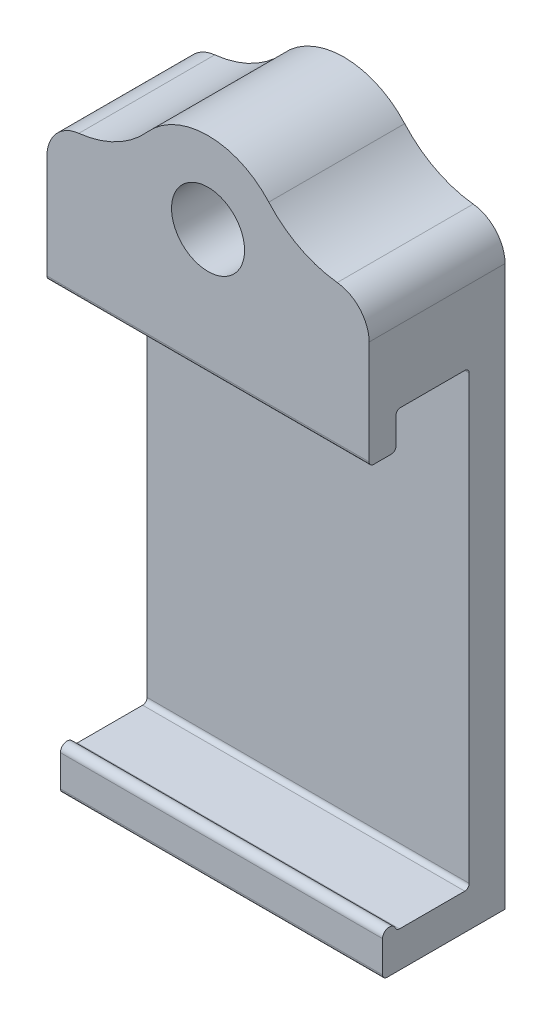
ISO-10303-21;
HEADER;
FILE_DESCRIPTION(('STEP AP214'),'2;1');
FILE_NAME('part.step','',(''),(''),'','','');
FILE_SCHEMA(('AUTOMOTIVE_DESIGN { 1 0 10303 214 1 1 1 1 }'));
ENDSEC;
DATA;
#1=APPLICATION_CONTEXT('core data for automotive mechanical design processes');
#2=APPLICATION_PROTOCOL_DEFINITION('international standard','automotive_design',2000,#1);
#3=PRODUCT_CONTEXT('',#1,'mechanical');
#4=PRODUCT('Part','Part','',(#3));
#5=PRODUCT_RELATED_PRODUCT_CATEGORY('part','',(#4));
#6=PRODUCT_DEFINITION_FORMATION('','',#4);
#7=PRODUCT_DEFINITION_CONTEXT('part definition',#1,'design');
#8=PRODUCT_DEFINITION('design','',#6,#7);
#9=PRODUCT_DEFINITION_SHAPE('','',#8);
#10=(LENGTH_UNIT() NAMED_UNIT(*) SI_UNIT(.MILLI.,.METRE.));
#11=(NAMED_UNIT(*) PLANE_ANGLE_UNIT() SI_UNIT($,.RADIAN.));
#12=(NAMED_UNIT(*) SI_UNIT($,.STERADIAN.) SOLID_ANGLE_UNIT());
#13=UNCERTAINTY_MEASURE_WITH_UNIT(LENGTH_MEASURE(1.E-05),#10,'distance_accuracy_value','');
#14=(GEOMETRIC_REPRESENTATION_CONTEXT(3) GLOBAL_UNCERTAINTY_ASSIGNED_CONTEXT((#13)) GLOBAL_UNIT_ASSIGNED_CONTEXT((#10,
#11,#12)) REPRESENTATION_CONTEXT('',''));
#15=CARTESIAN_POINT('',(0.,0.,0.));
#16=DIRECTION('',(0.,0.,1.));
#17=DIRECTION('',(1.,0.,0.));
#18=AXIS2_PLACEMENT_3D('',#15,#16,#17);
#19=CARTESIAN_POINT('',(14.2875,20.,-3.25));
#20=DIRECTION('',(0.,0.,-1.));
#21=DIRECTION('',(-1.,0.,0.));
#22=AXIS2_PLACEMENT_3D('',#19,#20,#21);
#23=PLANE('',#22);
#24=DIRECTION('',(0.,-1.,0.));
#25=VECTOR('',#24,1.);
#26=CARTESIAN_POINT('',(14.2875,20.,-3.25));
#27=LINE('',#26,#25);
#28=CARTESIAN_POINT('',(14.2875,19.603125,-3.25));
#29=VERTEX_POINT('',#28);
#30=CARTESIAN_POINT('',(14.2875,-19.603125,-3.25));
#31=VERTEX_POINT('',#30);
#32=EDGE_CURVE('E280',#29,#31,#27,.T.);
#33=ORIENTED_EDGE('',*,*,#32,.F.);
#34=DIRECTION('',(-1.,0.,0.));
#35=VECTOR('',#34,1.);
#36=CARTESIAN_POINT('',(-14.2875,19.603125,-3.25));
#37=LINE('',#36,#35);
#38=CARTESIAN_POINT('',(-14.2875,19.603125,-3.25));
#39=VERTEX_POINT('',#38);
#40=EDGE_CURVE('E329',#29,#39,#37,.T.);
#41=ORIENTED_EDGE('',*,*,#40,.T.);
#42=DIRECTION('',(0.,-1.,0.));
#43=VECTOR('',#42,1.);
#44=CARTESIAN_POINT('',(-14.2875,20.,-3.25));
#45=LINE('',#44,#43);
#46=CARTESIAN_POINT('',(-14.2875,-19.603125,-3.25));
#47=VERTEX_POINT('',#46);
#48=EDGE_CURVE('E245',#39,#47,#45,.T.);
#49=ORIENTED_EDGE('',*,*,#48,.T.);
#50=DIRECTION('',(-1.,0.,0.));
#51=VECTOR('',#50,1.);
#52=CARTESIAN_POINT('',(14.2875,-19.603125,-3.25));
#53=LINE('',#52,#51);
#54=EDGE_CURVE('E326',#47,#31,#53,.F.);
#55=ORIENTED_EDGE('',*,*,#54,.T.);
#56=EDGE_LOOP('',(#33,#41,#49,#55));
#57=FACE_BOUND('',#56,.T.);
#58=ADVANCED_FACE('F39',(#57),#23,.F.);
#59=CARTESIAN_POINT('',(14.2875,-20.,-3.25));
#60=DIRECTION('',(0.,-1.,0.));
#61=DIRECTION('',(0.,0.,-1.));
#62=AXIS2_PLACEMENT_3D('',#59,#60,#61);
#63=PLANE('',#62);
#64=DIRECTION('',(0.,0.,1.));
#65=VECTOR('',#64,1.);
#66=CARTESIAN_POINT('',(14.2875,-20.,-3.25));
#67=LINE('',#66,#65);
#68=CARTESIAN_POINT('',(14.2875,-20.,-2.853125));
#69=VERTEX_POINT('',#68);
#70=CARTESIAN_POINT('',(14.2875,-20.,2.9359576355322));
#71=VERTEX_POINT('',#70);
#72=EDGE_CURVE('E203',#69,#71,#67,.T.);
#73=ORIENTED_EDGE('',*,*,#72,.F.);
#74=DIRECTION('',(-1.,0.,0.));
#75=VECTOR('',#74,1.);
#76=CARTESIAN_POINT('',(-14.2875,-20.,-2.853125));
#77=LINE('',#76,#75);
#78=CARTESIAN_POINT('',(-14.2875,-20.,-2.853125));
#79=VERTEX_POINT('',#78);
#80=EDGE_CURVE('E343',#69,#79,#77,.T.);
#81=ORIENTED_EDGE('',*,*,#80,.T.);
#82=DIRECTION('',(0.,0.,1.));
#83=VECTOR('',#82,1.);
#84=CARTESIAN_POINT('',(-14.2875,-20.,-3.25));
#85=LINE('',#84,#83);
#86=CARTESIAN_POINT('',(-14.2875,-20.,2.9359576355322));
#87=VERTEX_POINT('',#86);
#88=EDGE_CURVE('E249',#79,#87,#85,.T.);
#89=ORIENTED_EDGE('',*,*,#88,.T.);
#90=DIRECTION('',(1.,0.,0.));
#91=VECTOR('',#90,1.);
#92=CARTESIAN_POINT('',(14.2875,-20.,2.9359576355322));
#93=LINE('',#92,#91);
#94=EDGE_CURVE('E340',#87,#71,#93,.T.);
#95=ORIENTED_EDGE('',*,*,#94,.T.);
#96=EDGE_LOOP('',(#73,#81,#89,#95));
#97=FACE_BOUND('',#96,.T.);
#98=ADVANCED_FACE('F513',(#97),#63,.F.);
#99=CARTESIAN_POINT('',(14.2875,-20.,3.8453125));
#100=DIRECTION('',(-1.,0.,0.));
#101=DIRECTION('',(0.,0.,1.));
#102=AXIS2_PLACEMENT_3D('',#99,#100,#101);
#103=CYLINDRICAL_SURFACE('',#102,0.595312500000001);
#104=CARTESIAN_POINT('',(14.2875,-20.,3.8453125));
#105=DIRECTION('',(1.,0.,0.));
#106=DIRECTION('',(0.,0.,-1.));
#107=AXIS2_PLACEMENT_3D('',#104,#105,#106);
#108=CIRCLE('',#107,0.595312500000001);
#109=CARTESIAN_POINT('',(14.2875,-19.761875,3.29969958131932));
#110=VERTEX_POINT('',#109);
#111=CARTESIAN_POINT('',(14.2875,-20.,4.440625));
#112=VERTEX_POINT('',#111);
#113=EDGE_CURVE('E189',#110,#112,#108,.T.);
#114=ORIENTED_EDGE('',*,*,#113,.F.);
#115=DIRECTION('',(-1.,0.,0.));
#116=VECTOR('',#115,1.);
#117=CARTESIAN_POINT('',(14.2875,-19.761875,3.29969958131932));
#118=LINE('',#117,#116);
#119=CARTESIAN_POINT('',(-14.2875,-19.761875,3.29969958131932));
#120=VERTEX_POINT('',#119);
#121=EDGE_CURVE('E347',#110,#120,#118,.T.);
#122=ORIENTED_EDGE('',*,*,#121,.T.);
#123=CARTESIAN_POINT('',(-14.2875,-20.,3.8453125));
#124=DIRECTION('',(1.,0.,0.));
#125=DIRECTION('',(0.,0.,-1.));
#126=AXIS2_PLACEMENT_3D('',#123,#124,#125);
#127=CIRCLE('',#126,0.595312500000001);
#128=CARTESIAN_POINT('',(-14.2875,-20.,4.440625));
#129=VERTEX_POINT('',#128);
#130=EDGE_CURVE('E209',#120,#129,#127,.T.);
#131=ORIENTED_EDGE('',*,*,#130,.T.);
#132=DIRECTION('',(-1.,0.,0.));
#133=VECTOR('',#132,1.);
#134=CARTESIAN_POINT('',(14.2875,-20.,4.440625));
#135=LINE('',#134,#133);
#136=EDGE_CURVE('E206',#112,#129,#135,.T.);
#137=ORIENTED_EDGE('',*,*,#136,.F.);
#138=EDGE_LOOP('',(#114,#122,#131,#137));
#139=FACE_BOUND('',#138,.T.);
#140=ADVANCED_FACE('F207',(#139),#103,.T.);
#141=CARTESIAN_POINT('',(14.2875,-23.175,4.440625));
#142=DIRECTION('',(0.,0.,-1.));
#143=DIRECTION('',(0.,1.,0.));
#144=AXIS2_PLACEMENT_3D('',#141,#142,#143);
#145=PLANE('',#144);
#146=DIRECTION('',(0.,-1.,0.));
#147=VECTOR('',#146,1.);
#148=CARTESIAN_POINT('',(-14.2875,-23.175,4.440625));
#149=LINE('',#148,#147);
#150=CARTESIAN_POINT('',(-14.2875,-22.778125,4.440625));
#151=VERTEX_POINT('',#150);
#152=EDGE_CURVE('E256',#129,#151,#149,.T.);
#153=ORIENTED_EDGE('',*,*,#152,.T.);
#154=DIRECTION('',(-1.,0.,0.));
#155=VECTOR('',#154,1.);
#156=CARTESIAN_POINT('',(14.2875,-22.778125,4.440625));
#157=LINE('',#156,#155);
#158=CARTESIAN_POINT('',(14.2875,-22.778125,4.440625));
#159=VERTEX_POINT('',#158);
#160=EDGE_CURVE('E219',#151,#159,#157,.F.);
#161=ORIENTED_EDGE('',*,*,#160,.T.);
#162=DIRECTION('',(0.,-1.,0.));
#163=VECTOR('',#162,1.);
#164=CARTESIAN_POINT('',(14.2875,-23.175,4.440625));
#165=LINE('',#164,#163);
#166=EDGE_CURVE('E194',#112,#159,#165,.T.);
#167=ORIENTED_EDGE('',*,*,#166,.F.);
#168=ORIENTED_EDGE('',*,*,#136,.T.);
#169=EDGE_LOOP('',(#153,#161,#167,#168));
#170=FACE_BOUND('',#169,.T.);
#171=ADVANCED_FACE('F217',(#170),#145,.F.);
#172=CARTESIAN_POINT('',(14.2875,-23.175,-6.425));
#173=DIRECTION('',(0.,1.,0.));
#174=DIRECTION('',(0.,0.,1.));
#175=AXIS2_PLACEMENT_3D('',#172,#173,#174);
#176=PLANE('',#175);
#177=DIRECTION('',(0.,0.,-1.));
#178=VECTOR('',#177,1.);
#179=CARTESIAN_POINT('',(14.2875,-23.175,-6.425));
#180=LINE('',#179,#178);
#181=CARTESIAN_POINT('',(14.2875,-23.175,4.04375));
#182=VERTEX_POINT('',#181);
#183=CARTESIAN_POINT('',(14.2875,-23.175,-6.425));
#184=VERTEX_POINT('',#183);
#185=EDGE_CURVE('E221',#182,#184,#180,.T.);
#186=ORIENTED_EDGE('',*,*,#185,.F.);
#187=DIRECTION('',(-1.,0.,0.));
#188=VECTOR('',#187,1.);
#189=CARTESIAN_POINT('',(14.2875,-23.175,4.04375));
#190=LINE('',#189,#188);
#191=CARTESIAN_POINT('',(-14.2875,-23.175,4.04375));
#192=VERTEX_POINT('',#191);
#193=EDGE_CURVE('E320',#182,#192,#190,.T.);
#194=ORIENTED_EDGE('',*,*,#193,.T.);
#195=DIRECTION('',(0.,0.,-1.));
#196=VECTOR('',#195,1.);
#197=CARTESIAN_POINT('',(-14.2875,-23.175,-6.425));
#198=LINE('',#197,#196);
#199=CARTESIAN_POINT('',(-14.2875,-23.175,-6.425));
#200=VERTEX_POINT('',#199);
#201=EDGE_CURVE('E259',#192,#200,#198,.T.);
#202=ORIENTED_EDGE('',*,*,#201,.T.);
#203=DIRECTION('',(-1.,0.,0.));
#204=VECTOR('',#203,1.);
#205=CARTESIAN_POINT('',(14.2875,-23.175,-6.425));
#206=LINE('',#205,#204);
#207=EDGE_CURVE('E215',#184,#200,#206,.T.);
#208=ORIENTED_EDGE('',*,*,#207,.F.);
#209=EDGE_LOOP('',(#186,#194,#202,#208));
#210=FACE_BOUND('',#209,.T.);
#211=ADVANCED_FACE('F510',(#210),#176,.F.);
#212=CARTESIAN_POINT('',(14.2875,23.175,-6.425));
#213=DIRECTION('',(0.,0.,1.));
#214=DIRECTION('',(0.,-1.,0.));
#215=AXIS2_PLACEMENT_3D('',#212,#213,#214);
#216=PLANE('',#215);
#217=CARTESIAN_POINT('',(0.,27.9375,-6.425));
#218=DIRECTION('',(0.,0.,1.));
#219=DIRECTION('',(1.,0.,0.));
#220=AXIS2_PLACEMENT_3D('',#217,#218,#219);
#221=CIRCLE('',#220,3.2385);
#222=CARTESIAN_POINT('',(3.2385,27.9375,-6.425));
#223=VERTEX_POINT('',#222);
#224=EDGE_CURVE('E250',#223,#223,#221,.T.);
#225=ORIENTED_EDGE('',*,*,#224,.T.);
#226=EDGE_LOOP('',(#225));
#227=FACE_BOUND('',#226,.T.);
#228=CARTESIAN_POINT('',(12.5092179536732,39.05,-6.425));
#229=DIRECTION('',(0.,0.,1.));
#230=DIRECTION('',(0.,-1.,0.));
#231=AXIS2_PLACEMENT_3D('',#228,#229,#230);
#232=CIRCLE('',#231,9.525);
#233=CARTESIAN_POINT('',(5.38822101609833,32.7240986717268,-6.425));
#234=VERTEX_POINT('',#233);
#235=CARTESIAN_POINT('',(11.4616794884183,29.5827782235858,-6.425));
#236=VERTEX_POINT('',#235);
#237=EDGE_CURVE('E387',#234,#236,#232,.T.);
#238=ORIENTED_EDGE('',*,*,#237,.T.);
#239=CARTESIAN_POINT('',(11.1125,26.4270376314477,-6.425));
#240=DIRECTION('',(0.,0.,1.));
#241=DIRECTION('',(0.,-1.,0.));
#242=AXIS2_PLACEMENT_3D('',#239,#240,#241);
#243=CIRCLE('',#242,3.175);
#244=CARTESIAN_POINT('',(14.2875,26.4270376314477,-6.425));
#245=VERTEX_POINT('',#244);
#246=EDGE_CURVE('E413',#236,#245,#243,.F.);
#247=ORIENTED_EDGE('',*,*,#246,.T.);
#248=DIRECTION('',(0.,1.,0.));
#249=VECTOR('',#248,1.);
#250=CARTESIAN_POINT('',(14.2875,23.175,-6.425));
#251=LINE('',#250,#249);
#252=EDGE_CURVE('E224',#184,#245,#251,.T.);
#253=ORIENTED_EDGE('',*,*,#252,.F.);
#254=ORIENTED_EDGE('',*,*,#207,.T.);
#255=DIRECTION('',(0.,1.,0.));
#256=VECTOR('',#255,1.);
#257=CARTESIAN_POINT('',(-14.2875,23.175,-6.425));
#258=LINE('',#257,#256);
#259=CARTESIAN_POINT('',(-14.2875,26.4270376314477,-6.425));
#260=VERTEX_POINT('',#259);
#261=EDGE_CURVE('E262',#200,#260,#258,.T.);
#262=ORIENTED_EDGE('',*,*,#261,.T.);
#263=CARTESIAN_POINT('',(-11.1125,26.4270376314477,-6.425));
#264=DIRECTION('',(0.,0.,1.));
#265=DIRECTION('',(0.,-1.,0.));
#266=AXIS2_PLACEMENT_3D('',#263,#264,#265);
#267=CIRCLE('',#266,3.175);
#268=CARTESIAN_POINT('',(-11.4616794884183,29.5827782235858,-6.425));
#269=VERTEX_POINT('',#268);
#270=EDGE_CURVE('E60',#260,#269,#267,.F.);
#271=ORIENTED_EDGE('',*,*,#270,.T.);
#272=CARTESIAN_POINT('',(-12.5092179536732,39.05,-6.425));
#273=DIRECTION('',(0.,0.,1.));
#274=DIRECTION('',(0.,-1.,0.));
#275=AXIS2_PLACEMENT_3D('',#272,#273,#274);
#276=CIRCLE('',#275,9.525);
#277=CARTESIAN_POINT('',(-5.38822101609833,32.7240986717268,-6.425));
#278=VERTEX_POINT('',#277);
#279=EDGE_CURVE('E395',#269,#278,#276,.T.);
#280=ORIENTED_EDGE('',*,*,#279,.T.);
#281=CARTESIAN_POINT('',(0.,27.9375,-6.425));
#282=DIRECTION('',(0.,0.,-1.));
#283=DIRECTION('',(1.,0.,0.));
#284=AXIS2_PLACEMENT_3D('',#281,#282,#283);
#285=CIRCLE('',#284,7.20725);
#286=EDGE_CURVE('E439',#278,#234,#285,.T.);
#287=ORIENTED_EDGE('',*,*,#286,.T.);
#288=EDGE_LOOP('',(#238,#247,#253,#254,#262,#271,#280,#287));
#289=FACE_BOUND('',#288,.T.);
#290=ADVANCED_FACE('F437',(#227,#289),#216,.F.);
#291=CARTESIAN_POINT('',(14.2875,16.825,5.63125));
#292=DIRECTION('',(0.,0.,-1.));
#293=DIRECTION('',(-1.,0.,0.));
#294=AXIS2_PLACEMENT_3D('',#291,#292,#293);
#295=PLANE('',#294);
#296=CARTESIAN_POINT('',(0.,27.9375,5.63125));
#297=DIRECTION('',(0.,0.,1.));
#298=DIRECTION('',(1.,0.,0.));
#299=AXIS2_PLACEMENT_3D('',#296,#297,#298);
#300=CIRCLE('',#299,3.2385);
#301=CARTESIAN_POINT('',(3.2385,27.9375,5.63125));
#302=VERTEX_POINT('',#301);
#303=EDGE_CURVE('E485',#302,#302,#300,.T.);
#304=ORIENTED_EDGE('',*,*,#303,.F.);
#305=EDGE_LOOP('',(#304));
#306=FACE_BOUND('',#305,.T.);
#307=DIRECTION('',(0.,-1.,0.));
#308=VECTOR('',#307,1.);
#309=CARTESIAN_POINT('',(14.2875,16.825,5.63125));
#310=LINE('',#309,#308);
#311=CARTESIAN_POINT('',(14.2875,26.4270376314477,5.63125));
#312=VERTEX_POINT('',#311);
#313=CARTESIAN_POINT('',(14.2875,17.221875,5.63125));
#314=VERTEX_POINT('',#313);
#315=EDGE_CURVE('E230',#312,#314,#310,.T.);
#316=ORIENTED_EDGE('',*,*,#315,.F.);
#317=CARTESIAN_POINT('',(11.1125,26.4270376314477,5.63125));
#318=DIRECTION('',(0.,0.,-1.));
#319=DIRECTION('',(-1.,0.,0.));
#320=AXIS2_PLACEMENT_3D('',#317,#318,#319);
#321=CIRCLE('',#320,3.175);
#322=CARTESIAN_POINT('',(11.4616794884183,29.5827782235858,5.63125));
#323=VERTEX_POINT('',#322);
#324=EDGE_CURVE('E405',#312,#323,#321,.F.);
#325=ORIENTED_EDGE('',*,*,#324,.T.);
#326=CARTESIAN_POINT('',(12.5092179536732,39.05,5.63125));
#327=DIRECTION('',(0.,0.,-1.));
#328=DIRECTION('',(-1.,0.,0.));
#329=AXIS2_PLACEMENT_3D('',#326,#327,#328);
#330=CIRCLE('',#329,9.525);
#331=CARTESIAN_POINT('',(5.38822101609833,32.7240986717268,5.63125));
#332=VERTEX_POINT('',#331);
#333=EDGE_CURVE('E384',#323,#332,#330,.T.);
#334=ORIENTED_EDGE('',*,*,#333,.T.);
#335=CARTESIAN_POINT('',(0.,27.9375,5.63125));
#336=DIRECTION('',(0.,0.,1.));
#337=DIRECTION('',(1.,0.,0.));
#338=AXIS2_PLACEMENT_3D('',#335,#336,#337);
#339=CIRCLE('',#338,7.20725);
#340=CARTESIAN_POINT('',(-5.38822101609833,32.7240986717268,5.63125));
#341=VERTEX_POINT('',#340);
#342=EDGE_CURVE('E373',#332,#341,#339,.T.);
#343=ORIENTED_EDGE('',*,*,#342,.T.);
#344=CARTESIAN_POINT('',(-12.5092179536732,39.05,5.63125));
#345=DIRECTION('',(0.,0.,-1.));
#346=DIRECTION('',(-1.,0.,0.));
#347=AXIS2_PLACEMENT_3D('',#344,#345,#346);
#348=CIRCLE('',#347,9.525);
#349=CARTESIAN_POINT('',(-11.4616794884183,29.5827782235858,5.63125));
#350=VERTEX_POINT('',#349);
#351=EDGE_CURVE('E391',#341,#350,#348,.T.);
#352=ORIENTED_EDGE('',*,*,#351,.T.);
#353=CARTESIAN_POINT('',(-11.1125,26.4270376314477,5.63125));
#354=DIRECTION('',(0.,0.,-1.));
#355=DIRECTION('',(-1.,0.,0.));
#356=AXIS2_PLACEMENT_3D('',#353,#354,#355);
#357=CIRCLE('',#356,3.175);
#358=CARTESIAN_POINT('',(-14.2875,26.4270376314477,5.63125));
#359=VERTEX_POINT('',#358);
#360=EDGE_CURVE('E402',#350,#359,#357,.F.);
#361=ORIENTED_EDGE('',*,*,#360,.T.);
#362=DIRECTION('',(0.,-1.,0.));
#363=VECTOR('',#362,1.);
#364=CARTESIAN_POINT('',(-14.2875,16.825,5.63125));
#365=LINE('',#364,#363);
#366=CARTESIAN_POINT('',(-14.2875,17.221875,5.63125));
#367=VERTEX_POINT('',#366);
#368=EDGE_CURVE('E265',#359,#367,#365,.T.);
#369=ORIENTED_EDGE('',*,*,#368,.T.);
#370=DIRECTION('',(-1.,0.,0.));
#371=VECTOR('',#370,1.);
#372=CARTESIAN_POINT('',(14.2875,17.221875,5.63125));
#373=LINE('',#372,#371);
#374=EDGE_CURVE('E316',#367,#314,#373,.F.);
#375=ORIENTED_EDGE('',*,*,#374,.T.);
#376=EDGE_LOOP('',(#316,#325,#334,#343,#352,#361,#369,#375));
#377=FACE_BOUND('',#376,.T.);
#378=ADVANCED_FACE('F424',(#306,#377),#295,.F.);
#379=CARTESIAN_POINT('',(14.2875,16.825,3.25));
#380=DIRECTION('',(0.,1.,0.));
#381=DIRECTION('',(0.,0.,1.));
#382=AXIS2_PLACEMENT_3D('',#379,#380,#381);
#383=PLANE('',#382);
#384=DIRECTION('',(0.,0.,-1.));
#385=VECTOR('',#384,1.);
#386=CARTESIAN_POINT('',(-14.2875,16.825,3.25));
#387=LINE('',#386,#385);
#388=CARTESIAN_POINT('',(-14.2875,16.825,5.234375));
#389=VERTEX_POINT('',#388);
#390=CARTESIAN_POINT('',(-14.2875,16.825,3.646875));
#391=VERTEX_POINT('',#390);
#392=EDGE_CURVE('E268',#389,#391,#387,.T.);
#393=ORIENTED_EDGE('',*,*,#392,.T.);
#394=DIRECTION('',(-1.,0.,0.));
#395=VECTOR('',#394,1.);
#396=CARTESIAN_POINT('',(14.2875,16.825,3.646875));
#397=LINE('',#396,#395);
#398=CARTESIAN_POINT('',(14.2875,16.825,3.646875));
#399=VERTEX_POINT('',#398);
#400=EDGE_CURVE('E304',#391,#399,#397,.F.);
#401=ORIENTED_EDGE('',*,*,#400,.T.);
#402=DIRECTION('',(0.,0.,-1.));
#403=VECTOR('',#402,1.);
#404=CARTESIAN_POINT('',(14.2875,16.825,3.25));
#405=LINE('',#404,#403);
#406=CARTESIAN_POINT('',(14.2875,16.825,5.234375));
#407=VERTEX_POINT('',#406);
#408=EDGE_CURVE('E233',#407,#399,#405,.T.);
#409=ORIENTED_EDGE('',*,*,#408,.F.);
#410=DIRECTION('',(-1.,0.,0.));
#411=VECTOR('',#410,1.);
#412=CARTESIAN_POINT('',(14.2875,16.825,5.234375));
#413=LINE('',#412,#411);
#414=EDGE_CURVE('E300',#407,#389,#413,.T.);
#415=ORIENTED_EDGE('',*,*,#414,.T.);
#416=EDGE_LOOP('',(#393,#401,#409,#415));
#417=FACE_BOUND('',#416,.T.);
#418=ADVANCED_FACE('F451',(#417),#383,.F.);
#419=CARTESIAN_POINT('',(14.2875,16.825,3.25));
#420=DIRECTION('',(0.,0.,1.));
#421=DIRECTION('',(0.,-1.,0.));
#422=AXIS2_PLACEMENT_3D('',#419,#420,#421);
#423=PLANE('',#422);
#424=DIRECTION('',(0.,1.,0.));
#425=VECTOR('',#424,1.);
#426=CARTESIAN_POINT('',(14.2875,16.825,3.25));
#427=LINE('',#426,#425);
#428=CARTESIAN_POINT('',(14.2875,17.221875,3.25));
#429=VERTEX_POINT('',#428);
#430=CARTESIAN_POINT('',(14.2875,19.603125,3.25));
#431=VERTEX_POINT('',#430);
#432=EDGE_CURVE('E237',#429,#431,#427,.T.);
#433=ORIENTED_EDGE('',*,*,#432,.F.);
#434=DIRECTION('',(-1.,0.,0.));
#435=VECTOR('',#434,1.);
#436=CARTESIAN_POINT('',(14.2875,17.221875,3.25));
#437=LINE('',#436,#435);
#438=CARTESIAN_POINT('',(-14.2875,17.221875,3.25));
#439=VERTEX_POINT('',#438);
#440=EDGE_CURVE('E286',#429,#439,#437,.T.);
#441=ORIENTED_EDGE('',*,*,#440,.T.);
#442=DIRECTION('',(0.,1.,0.));
#443=VECTOR('',#442,1.);
#444=CARTESIAN_POINT('',(-14.2875,16.825,3.25));
#445=LINE('',#444,#443);
#446=CARTESIAN_POINT('',(-14.2875,19.603125,3.25));
#447=VERTEX_POINT('',#446);
#448=EDGE_CURVE('E272',#439,#447,#445,.T.);
#449=ORIENTED_EDGE('',*,*,#448,.T.);
#450=DIRECTION('',(-1.,0.,0.));
#451=VECTOR('',#450,1.);
#452=CARTESIAN_POINT('',(14.2875,19.603125,3.25));
#453=LINE('',#452,#451);
#454=EDGE_CURVE('E214',#447,#431,#453,.F.);
#455=ORIENTED_EDGE('',*,*,#454,.T.);
#456=EDGE_LOOP('',(#433,#441,#449,#455));
#457=FACE_BOUND('',#456,.T.);
#458=ADVANCED_FACE('F460',(#457),#423,.F.);
#459=CARTESIAN_POINT('',(14.2875,20.,3.25));
#460=DIRECTION('',(0.,1.,0.));
#461=DIRECTION('',(0.,0.,1.));
#462=AXIS2_PLACEMENT_3D('',#459,#460,#461);
#463=PLANE('',#462);
#464=DIRECTION('',(0.,0.,-1.));
#465=VECTOR('',#464,1.);
#466=CARTESIAN_POINT('',(-14.2875,20.,3.25));
#467=LINE('',#466,#465);
#468=CARTESIAN_POINT('',(-14.2875,20.,2.853125));
#469=VERTEX_POINT('',#468);
#470=CARTESIAN_POINT('',(-14.2875,20.,-2.853125));
#471=VERTEX_POINT('',#470);
#472=EDGE_CURVE('E276',#469,#471,#467,.T.);
#473=ORIENTED_EDGE('',*,*,#472,.T.);
#474=DIRECTION('',(-1.,0.,0.));
#475=VECTOR('',#474,1.);
#476=CARTESIAN_POINT('',(14.2875,20.,-2.853125));
#477=LINE('',#476,#475);
#478=CARTESIAN_POINT('',(14.2875,20.,-2.853125));
#479=VERTEX_POINT('',#478);
#480=EDGE_CURVE('E337',#471,#479,#477,.F.);
#481=ORIENTED_EDGE('',*,*,#480,.T.);
#482=DIRECTION('',(0.,0.,-1.));
#483=VECTOR('',#482,1.);
#484=CARTESIAN_POINT('',(14.2875,20.,3.25));
#485=LINE('',#484,#483);
#486=CARTESIAN_POINT('',(14.2875,20.,2.853125));
#487=VERTEX_POINT('',#486);
#488=EDGE_CURVE('E241',#487,#479,#485,.T.);
#489=ORIENTED_EDGE('',*,*,#488,.F.);
#490=DIRECTION('',(-1.,0.,0.));
#491=VECTOR('',#490,1.);
#492=CARTESIAN_POINT('',(-14.2875,20.,2.853125));
#493=LINE('',#492,#491);
#494=EDGE_CURVE('E333',#487,#469,#493,.T.);
#495=ORIENTED_EDGE('',*,*,#494,.T.);
#496=EDGE_LOOP('',(#473,#481,#489,#495));
#497=FACE_BOUND('',#496,.T.);
#498=ADVANCED_FACE('F469',(#497),#463,.F.);
#499=CARTESIAN_POINT('',(14.2875,-20.,3.8453125));
#500=DIRECTION('',(1.,0.,0.));
#501=DIRECTION('',(0.,0.,-1.));
#502=AXIS2_PLACEMENT_3D('',#499,#500,#501);
#503=PLANE('',#502);
#504=ORIENTED_EDGE('',*,*,#252,.T.);
#505=DIRECTION('',(0.,0.,-1.));
#506=VECTOR('',#505,1.);
#507=CARTESIAN_POINT('',(14.2875,26.4270376314477,5.63125));
#508=LINE('',#507,#506);
#509=EDGE_CURVE('E398',#245,#312,#508,.F.);
#510=ORIENTED_EDGE('',*,*,#509,.T.);
#511=ORIENTED_EDGE('',*,*,#315,.T.);
#512=CARTESIAN_POINT('',(14.2875,17.221875,5.234375));
#513=DIRECTION('',(1.,0.,0.));
#514=DIRECTION('',(0.,0.,-1.));
#515=AXIS2_PLACEMENT_3D('',#512,#513,#514);
#516=CIRCLE('',#515,0.396875);
#517=EDGE_CURVE('E310',#314,#407,#516,.T.);
#518=ORIENTED_EDGE('',*,*,#517,.T.);
#519=ORIENTED_EDGE('',*,*,#408,.T.);
#520=CARTESIAN_POINT('',(14.2875,17.221875,3.646875));
#521=DIRECTION('',(1.,0.,0.));
#522=DIRECTION('',(0.,0.,-1.));
#523=AXIS2_PLACEMENT_3D('',#520,#521,#522);
#524=CIRCLE('',#523,0.396875);
#525=EDGE_CURVE('E313',#399,#429,#524,.T.);
#526=ORIENTED_EDGE('',*,*,#525,.T.);
#527=ORIENTED_EDGE('',*,*,#432,.T.);
#528=CARTESIAN_POINT('',(14.2875,19.603125,2.853125));
#529=DIRECTION('',(1.,0.,0.));
#530=DIRECTION('',(0.,0.,-1.));
#531=AXIS2_PLACEMENT_3D('',#528,#529,#530);
#532=CIRCLE('',#531,0.396875);
#533=EDGE_CURVE('E359',#431,#487,#532,.F.);
#534=ORIENTED_EDGE('',*,*,#533,.T.);
#535=ORIENTED_EDGE('',*,*,#488,.T.);
#536=CARTESIAN_POINT('',(14.2875,19.603125,-2.853125));
#537=DIRECTION('',(1.,0.,0.));
#538=DIRECTION('',(0.,0.,-1.));
#539=AXIS2_PLACEMENT_3D('',#536,#537,#538);
#540=CIRCLE('',#539,0.396875);
#541=EDGE_CURVE('E353',#479,#29,#540,.F.);
#542=ORIENTED_EDGE('',*,*,#541,.T.);
#543=ORIENTED_EDGE('',*,*,#32,.T.);
#544=CARTESIAN_POINT('',(14.2875,-19.603125,-2.853125));
#545=DIRECTION('',(1.,0.,0.));
#546=DIRECTION('',(0.,0.,-1.));
#547=AXIS2_PLACEMENT_3D('',#544,#545,#546);
#548=CIRCLE('',#547,0.396875);
#549=EDGE_CURVE('E365',#31,#69,#548,.F.);
#550=ORIENTED_EDGE('',*,*,#549,.T.);
#551=ORIENTED_EDGE('',*,*,#72,.T.);
#552=CARTESIAN_POINT('',(14.2875,-19.603125,2.9359576355322));
#553=DIRECTION('',(1.,0.,0.));
#554=DIRECTION('',(0.,0.,-1.));
#555=AXIS2_PLACEMENT_3D('',#552,#553,#554);
#556=CIRCLE('',#555,0.396875);
#557=EDGE_CURVE('E198',#71,#110,#556,.F.);
#558=ORIENTED_EDGE('',*,*,#557,.T.);
#559=ORIENTED_EDGE('',*,*,#113,.T.);
#560=ORIENTED_EDGE('',*,*,#166,.T.);
#561=CARTESIAN_POINT('',(14.2875,-22.778125,4.04375));
#562=DIRECTION('',(1.,0.,0.));
#563=DIRECTION('',(0.,0.,-1.));
#564=AXIS2_PLACEMENT_3D('',#561,#562,#563);
#565=CIRCLE('',#564,0.396875);
#566=EDGE_CURVE('E307',#159,#182,#565,.T.);
#567=ORIENTED_EDGE('',*,*,#566,.T.);
#568=ORIENTED_EDGE('',*,*,#185,.T.);
#569=EDGE_LOOP('',(#504,#510,#511,#518,#519,#526,#527,#534,#535,#542,#543,#550,#551,#558,#559,
#560,#567,#568));
#570=FACE_BOUND('',#569,.T.);
#571=ADVANCED_FACE('F192',(#570),#503,.T.);
#572=CARTESIAN_POINT('',(-14.2875,-20.,3.8453125));
#573=DIRECTION('',(1.,0.,0.));
#574=DIRECTION('',(0.,0.,-1.));
#575=AXIS2_PLACEMENT_3D('',#572,#573,#574);
#576=PLANE('',#575);
#577=ORIENTED_EDGE('',*,*,#368,.F.);
#578=DIRECTION('',(0.,0.,1.));
#579=VECTOR('',#578,1.);
#580=CARTESIAN_POINT('',(-14.2875,26.4270376314477,3.8453125));
#581=LINE('',#580,#579);
#582=EDGE_CURVE('E11',#359,#260,#581,.F.);
#583=ORIENTED_EDGE('',*,*,#582,.T.);
#584=ORIENTED_EDGE('',*,*,#261,.F.);
#585=ORIENTED_EDGE('',*,*,#201,.F.);
#586=CARTESIAN_POINT('',(-14.2875,-22.778125,4.04375));
#587=DIRECTION('',(1.,0.,0.));
#588=DIRECTION('',(0.,0.,-1.));
#589=AXIS2_PLACEMENT_3D('',#586,#587,#588);
#590=CIRCLE('',#589,0.396875);
#591=EDGE_CURVE('E290',#192,#151,#590,.F.);
#592=ORIENTED_EDGE('',*,*,#591,.T.);
#593=ORIENTED_EDGE('',*,*,#152,.F.);
#594=ORIENTED_EDGE('',*,*,#130,.F.);
#595=CARTESIAN_POINT('',(-14.2875,-19.603125,2.9359576355322));
#596=DIRECTION('',(1.,0.,0.));
#597=DIRECTION('',(0.,0.,-1.));
#598=AXIS2_PLACEMENT_3D('',#595,#596,#597);
#599=CIRCLE('',#598,0.396875);
#600=EDGE_CURVE('E368',#120,#87,#599,.T.);
#601=ORIENTED_EDGE('',*,*,#600,.T.);
#602=ORIENTED_EDGE('',*,*,#88,.F.);
#603=CARTESIAN_POINT('',(-14.2875,-19.603125,-2.853125));
#604=DIRECTION('',(1.,0.,0.));
#605=DIRECTION('',(0.,0.,-1.));
#606=AXIS2_PLACEMENT_3D('',#603,#604,#605);
#607=CIRCLE('',#606,0.396875);
#608=EDGE_CURVE('E362',#79,#47,#607,.T.);
#609=ORIENTED_EDGE('',*,*,#608,.T.);
#610=ORIENTED_EDGE('',*,*,#48,.F.);
#611=CARTESIAN_POINT('',(-14.2875,19.603125,-2.853125));
#612=DIRECTION('',(1.,0.,0.));
#613=DIRECTION('',(0.,0.,-1.));
#614=AXIS2_PLACEMENT_3D('',#611,#612,#613);
#615=CIRCLE('',#614,0.396875);
#616=EDGE_CURVE('E350',#39,#471,#615,.T.);
#617=ORIENTED_EDGE('',*,*,#616,.T.);
#618=ORIENTED_EDGE('',*,*,#472,.F.);
#619=CARTESIAN_POINT('',(-14.2875,19.603125,2.853125));
#620=DIRECTION('',(1.,0.,0.));
#621=DIRECTION('',(0.,0.,-1.));
#622=AXIS2_PLACEMENT_3D('',#619,#620,#621);
#623=CIRCLE('',#622,0.396875);
#624=EDGE_CURVE('E356',#469,#447,#623,.T.);
#625=ORIENTED_EDGE('',*,*,#624,.T.);
#626=ORIENTED_EDGE('',*,*,#448,.F.);
#627=CARTESIAN_POINT('',(-14.2875,17.221875,3.646875));
#628=DIRECTION('',(1.,0.,0.));
#629=DIRECTION('',(0.,0.,-1.));
#630=AXIS2_PLACEMENT_3D('',#627,#628,#629);
#631=CIRCLE('',#630,0.396875);
#632=EDGE_CURVE('E297',#439,#391,#631,.F.);
#633=ORIENTED_EDGE('',*,*,#632,.T.);
#634=ORIENTED_EDGE('',*,*,#392,.F.);
#635=CARTESIAN_POINT('',(-14.2875,17.221875,5.234375));
#636=DIRECTION('',(1.,0.,0.));
#637=DIRECTION('',(0.,0.,-1.));
#638=AXIS2_PLACEMENT_3D('',#635,#636,#637);
#639=CIRCLE('',#638,0.396875);
#640=EDGE_CURVE('E293',#389,#367,#639,.F.);
#641=ORIENTED_EDGE('',*,*,#640,.T.);
#642=EDGE_LOOP('',(#577,#583,#584,#585,#592,#593,#594,#601,#602,#609,#610,#617,#618,#625,#626,
#633,#634,#641));
#643=FACE_BOUND('',#642,.T.);
#644=ADVANCED_FACE('F499',(#643),#576,.F.);
#645=CARTESIAN_POINT('',(0.,27.9375,-6.425));
#646=DIRECTION('',(0.,0.,1.));
#647=DIRECTION('',(1.,0.,0.));
#648=AXIS2_PLACEMENT_3D('',#645,#646,#647);
#649=CYLINDRICAL_SURFACE('',#648,3.2385);
#650=ORIENTED_EDGE('',*,*,#224,.F.);
#651=EDGE_LOOP('',(#650));
#652=FACE_BOUND('',#651,.T.);
#653=ORIENTED_EDGE('',*,*,#303,.T.);
#654=EDGE_LOOP('',(#653));
#655=FACE_BOUND('',#654,.T.);
#656=ADVANCED_FACE('F496',(#652,#655),#649,.F.);
#657=CARTESIAN_POINT('',(14.2875,17.221875,3.646875));
#658=DIRECTION('',(-1.,0.,0.));
#659=DIRECTION('',(0.,0.,1.));
#660=AXIS2_PLACEMENT_3D('',#657,#658,#659);
#661=CYLINDRICAL_SURFACE('',#660,0.396875);
#662=ORIENTED_EDGE('',*,*,#525,.F.);
#663=ORIENTED_EDGE('',*,*,#400,.F.);
#664=ORIENTED_EDGE('',*,*,#632,.F.);
#665=ORIENTED_EDGE('',*,*,#440,.F.);
#666=EDGE_LOOP('',(#662,#663,#664,#665));
#667=FACE_BOUND('',#666,.T.);
#668=ADVANCED_FACE('F455',(#667),#661,.T.);
#669=CARTESIAN_POINT('',(14.2875,17.221875,5.234375));
#670=DIRECTION('',(-1.,0.,0.));
#671=DIRECTION('',(0.,0.,1.));
#672=AXIS2_PLACEMENT_3D('',#669,#670,#671);
#673=CYLINDRICAL_SURFACE('',#672,0.396875);
#674=ORIENTED_EDGE('',*,*,#517,.F.);
#675=ORIENTED_EDGE('',*,*,#374,.F.);
#676=ORIENTED_EDGE('',*,*,#640,.F.);
#677=ORIENTED_EDGE('',*,*,#414,.F.);
#678=EDGE_LOOP('',(#674,#675,#676,#677));
#679=FACE_BOUND('',#678,.T.);
#680=ADVANCED_FACE('F447',(#679),#673,.T.);
#681=CARTESIAN_POINT('',(14.2875,-22.778125,4.04375));
#682=DIRECTION('',(-1.,0.,0.));
#683=DIRECTION('',(0.,0.,1.));
#684=AXIS2_PLACEMENT_3D('',#681,#682,#683);
#685=CYLINDRICAL_SURFACE('',#684,0.396875);
#686=ORIENTED_EDGE('',*,*,#566,.F.);
#687=ORIENTED_EDGE('',*,*,#160,.F.);
#688=ORIENTED_EDGE('',*,*,#591,.F.);
#689=ORIENTED_EDGE('',*,*,#193,.F.);
#690=EDGE_LOOP('',(#686,#687,#688,#689));
#691=FACE_BOUND('',#690,.T.);
#692=ADVANCED_FACE('F526',(#691),#685,.T.);
#693=CARTESIAN_POINT('',(14.2875,19.603125,-2.853125));
#694=DIRECTION('',(1.,0.,0.));
#695=DIRECTION('',(0.,0.,-1.));
#696=AXIS2_PLACEMENT_3D('',#693,#694,#695);
#697=CYLINDRICAL_SURFACE('',#696,0.396875);
#698=ORIENTED_EDGE('',*,*,#541,.F.);
#699=ORIENTED_EDGE('',*,*,#480,.F.);
#700=ORIENTED_EDGE('',*,*,#616,.F.);
#701=ORIENTED_EDGE('',*,*,#40,.F.);
#702=EDGE_LOOP('',(#698,#699,#700,#701));
#703=FACE_BOUND('',#702,.T.);
#704=ADVANCED_FACE('F473',(#703),#697,.F.);
#705=CARTESIAN_POINT('',(14.2875,19.603125,2.853125));
#706=DIRECTION('',(1.,0.,0.));
#707=DIRECTION('',(0.,0.,-1.));
#708=AXIS2_PLACEMENT_3D('',#705,#706,#707);
#709=CYLINDRICAL_SURFACE('',#708,0.396875);
#710=ORIENTED_EDGE('',*,*,#533,.F.);
#711=ORIENTED_EDGE('',*,*,#454,.F.);
#712=ORIENTED_EDGE('',*,*,#624,.F.);
#713=ORIENTED_EDGE('',*,*,#494,.F.);
#714=EDGE_LOOP('',(#710,#711,#712,#713));
#715=FACE_BOUND('',#714,.T.);
#716=ADVANCED_FACE('F464',(#715),#709,.F.);
#717=CARTESIAN_POINT('',(14.2875,-19.603125,-2.853125));
#718=DIRECTION('',(1.,0.,0.));
#719=DIRECTION('',(0.,0.,-1.));
#720=AXIS2_PLACEMENT_3D('',#717,#718,#719);
#721=CYLINDRICAL_SURFACE('',#720,0.396875);
#722=ORIENTED_EDGE('',*,*,#549,.F.);
#723=ORIENTED_EDGE('',*,*,#54,.F.);
#724=ORIENTED_EDGE('',*,*,#608,.F.);
#725=ORIENTED_EDGE('',*,*,#80,.F.);
#726=EDGE_LOOP('',(#722,#723,#724,#725));
#727=FACE_BOUND('',#726,.T.);
#728=ADVANCED_FACE('F534',(#727),#721,.F.);
#729=CARTESIAN_POINT('',(14.2875,-19.603125,2.9359576355322));
#730=DIRECTION('',(-1.,0.,0.));
#731=DIRECTION('',(0.,0.,1.));
#732=AXIS2_PLACEMENT_3D('',#729,#730,#731);
#733=CYLINDRICAL_SURFACE('',#732,0.396875);
#734=ORIENTED_EDGE('',*,*,#557,.F.);
#735=ORIENTED_EDGE('',*,*,#94,.F.);
#736=ORIENTED_EDGE('',*,*,#600,.F.);
#737=ORIENTED_EDGE('',*,*,#121,.F.);
#738=EDGE_LOOP('',(#734,#735,#736,#737));
#739=FACE_BOUND('',#738,.T.);
#740=ADVANCED_FACE('F537',(#739),#733,.F.);
#741=CARTESIAN_POINT('',(0.,27.9375,-6.425));
#742=DIRECTION('',(0.,0.,1.));
#743=DIRECTION('',(1.,0.,0.));
#744=AXIS2_PLACEMENT_3D('',#741,#742,#743);
#745=CYLINDRICAL_SURFACE('',#744,7.20725);
#746=ORIENTED_EDGE('',*,*,#342,.F.);
#747=DIRECTION('',(0.,0.,1.));
#748=VECTOR('',#747,1.);
#749=CARTESIAN_POINT('',(5.38822101609833,32.7240986717268,-6.425));
#750=LINE('',#749,#748);
#751=EDGE_CURVE('E381',#332,#234,#750,.F.);
#752=ORIENTED_EDGE('',*,*,#751,.T.);
#753=ORIENTED_EDGE('',*,*,#286,.F.);
#754=DIRECTION('',(0.,0.,1.));
#755=VECTOR('',#754,1.);
#756=CARTESIAN_POINT('',(-5.38822101609833,32.7240986717268,-6.425));
#757=LINE('',#756,#755);
#758=EDGE_CURVE('E377',#278,#341,#757,.T.);
#759=ORIENTED_EDGE('',*,*,#758,.T.);
#760=EDGE_LOOP('',(#746,#752,#753,#759));
#761=FACE_BOUND('',#760,.T.);
#762=ADVANCED_FACE('F429',(#761),#745,.T.);
#763=CARTESIAN_POINT('',(12.5092179536732,39.05,-6.425));
#764=DIRECTION('',(0.,0.,1.));
#765=DIRECTION('',(1.,0.,0.));
#766=AXIS2_PLACEMENT_3D('',#763,#764,#765);
#767=CYLINDRICAL_SURFACE('',#766,9.525);
#768=ORIENTED_EDGE('',*,*,#333,.F.);
#769=DIRECTION('',(0.,0.,1.));
#770=VECTOR('',#769,1.);
#771=CARTESIAN_POINT('',(11.4616794884183,29.5827782235858,-6.425));
#772=LINE('',#771,#770);
#773=EDGE_CURVE('E408',#323,#236,#772,.F.);
#774=ORIENTED_EDGE('',*,*,#773,.T.);
#775=ORIENTED_EDGE('',*,*,#237,.F.);
#776=ORIENTED_EDGE('',*,*,#751,.F.);
#777=EDGE_LOOP('',(#768,#774,#775,#776));
#778=FACE_BOUND('',#777,.T.);
#779=ADVANCED_FACE('F434',(#778),#767,.F.);
#780=CARTESIAN_POINT('',(-12.5092179536732,39.05,-6.425));
#781=DIRECTION('',(0.,0.,1.));
#782=DIRECTION('',(1.,0.,0.));
#783=AXIS2_PLACEMENT_3D('',#780,#781,#782);
#784=CYLINDRICAL_SURFACE('',#783,9.525);
#785=ORIENTED_EDGE('',*,*,#279,.F.);
#786=DIRECTION('',(0.,0.,1.));
#787=VECTOR('',#786,1.);
#788=CARTESIAN_POINT('',(-11.4616794884183,29.5827782235858,-6.425));
#789=LINE('',#788,#787);
#790=EDGE_CURVE('E48',#269,#350,#789,.T.);
#791=ORIENTED_EDGE('',*,*,#790,.T.);
#792=ORIENTED_EDGE('',*,*,#351,.F.);
#793=ORIENTED_EDGE('',*,*,#758,.F.);
#794=EDGE_LOOP('',(#785,#791,#792,#793));
#795=FACE_BOUND('',#794,.T.);
#796=ADVANCED_FACE('F419',(#795),#784,.F.);
#797=CARTESIAN_POINT('',(11.1125,26.4270376314477,-6.425));
#798=DIRECTION('',(0.,0.,1.));
#799=DIRECTION('',(1.,0.,0.));
#800=AXIS2_PLACEMENT_3D('',#797,#798,#799);
#801=CYLINDRICAL_SURFACE('',#800,3.175);
#802=ORIENTED_EDGE('',*,*,#246,.F.);
#803=ORIENTED_EDGE('',*,*,#773,.F.);
#804=ORIENTED_EDGE('',*,*,#324,.F.);
#805=ORIENTED_EDGE('',*,*,#509,.F.);
#806=EDGE_LOOP('',(#802,#803,#804,#805));
#807=FACE_BOUND('',#806,.T.);
#808=ADVANCED_FACE('F442',(#807),#801,.T.);
#809=CARTESIAN_POINT('',(-11.1125,26.4270376314477,-6.425));
#810=DIRECTION('',(0.,0.,1.));
#811=DIRECTION('',(1.,0.,0.));
#812=AXIS2_PLACEMENT_3D('',#809,#810,#811);
#813=CYLINDRICAL_SURFACE('',#812,3.175);
#814=ORIENTED_EDGE('',*,*,#270,.F.);
#815=ORIENTED_EDGE('',*,*,#582,.F.);
#816=ORIENTED_EDGE('',*,*,#360,.F.);
#817=ORIENTED_EDGE('',*,*,#790,.F.);
#818=EDGE_LOOP('',(#814,#815,#816,#817));
#819=FACE_BOUND('',#818,.T.);
#820=ADVANCED_FACE('F41',(#819),#813,.T.);
#821=CLOSED_SHELL('',(#58,#98,#140,#171,#211,#290,#378,#418,#458,#498,#571,#644,#656,#668,#680,
#692,#704,#716,#728,#740,#762,#779,#796,#808,#820));
#822=MANIFOLD_SOLID_BREP('B2',#821);
#823=ADVANCED_BREP_SHAPE_REPRESENTATION('',(#18,#822),#14);
#824=SHAPE_DEFINITION_REPRESENTATION(#9,#823);
ENDSEC;
END-ISO-10303-21;
